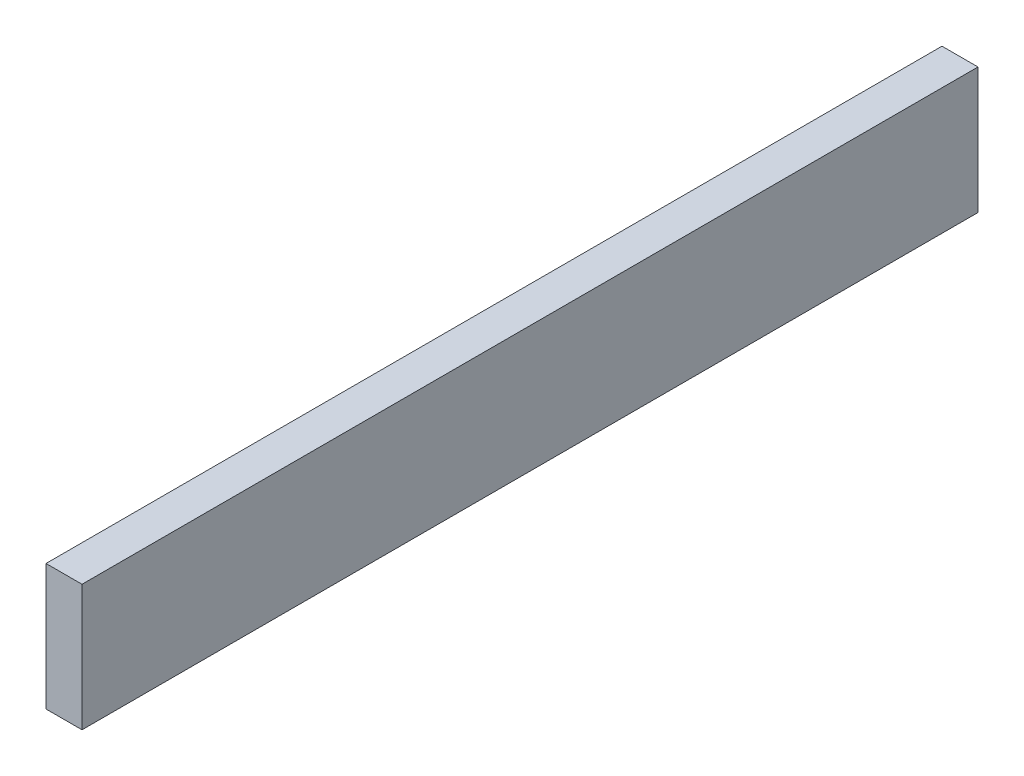
ISO-10303-21;
HEADER;
FILE_DESCRIPTION(('STEP AP214'),'2;1');
FILE_NAME('part.step','',(''),(''),'','','');
FILE_SCHEMA(('AUTOMOTIVE_DESIGN { 1 0 10303 214 1 1 1 1 }'));
ENDSEC;
DATA;
#1=APPLICATION_CONTEXT('core data for automotive mechanical design processes');
#2=APPLICATION_PROTOCOL_DEFINITION('international standard','automotive_design',2000,#1);
#3=PRODUCT_CONTEXT('',#1,'mechanical');
#4=PRODUCT('Part','Part','',(#3));
#5=PRODUCT_RELATED_PRODUCT_CATEGORY('part','',(#4));
#6=PRODUCT_DEFINITION_FORMATION('','',#4);
#7=PRODUCT_DEFINITION_CONTEXT('part definition',#1,'design');
#8=PRODUCT_DEFINITION('design','',#6,#7);
#9=PRODUCT_DEFINITION_SHAPE('','',#8);
#10=(LENGTH_UNIT() NAMED_UNIT(*) SI_UNIT(.MILLI.,.METRE.));
#11=(NAMED_UNIT(*) PLANE_ANGLE_UNIT() SI_UNIT($,.RADIAN.));
#12=(NAMED_UNIT(*) SI_UNIT($,.STERADIAN.) SOLID_ANGLE_UNIT());
#13=UNCERTAINTY_MEASURE_WITH_UNIT(LENGTH_MEASURE(1.E-05),#10,'distance_accuracy_value','');
#14=(GEOMETRIC_REPRESENTATION_CONTEXT(3) GLOBAL_UNCERTAINTY_ASSIGNED_CONTEXT((#13)) GLOBAL_UNIT_ASSIGNED_CONTEXT((#10,
#11,#12)) REPRESENTATION_CONTEXT('',''));
#15=CARTESIAN_POINT('',(0.,0.,0.));
#16=DIRECTION('',(0.,0.,1.));
#17=DIRECTION('',(1.,0.,0.));
#18=AXIS2_PLACEMENT_3D('',#15,#16,#17);
#19=CARTESIAN_POINT('',(-4.,7.,-49.75));
#20=DIRECTION('',(0.,0.,-1.));
#21=DIRECTION('',(0.,1.,0.));
#22=AXIS2_PLACEMENT_3D('',#19,#20,#21);
#23=PLANE('',#22);
#24=DIRECTION('',(0.,1.,0.));
#25=VECTOR('',#24,1.);
#26=CARTESIAN_POINT('',(0.,7.,-49.75));
#27=LINE('',#26,#25);
#28=CARTESIAN_POINT('',(0.,-7.,-49.75));
#29=VERTEX_POINT('',#28);
#30=CARTESIAN_POINT('',(0.,7.,-49.75));
#31=VERTEX_POINT('',#30);
#32=EDGE_CURVE('E101',#29,#31,#27,.T.);
#33=ORIENTED_EDGE('',*,*,#32,.F.);
#34=DIRECTION('',(1.,0.,0.));
#35=VECTOR('',#34,1.);
#36=CARTESIAN_POINT('',(-4.,-7.,-49.75));
#37=LINE('',#36,#35);
#38=CARTESIAN_POINT('',(-4.,-7.,-49.75));
#39=VERTEX_POINT('',#38);
#40=EDGE_CURVE('E11',#39,#29,#37,.T.);
#41=ORIENTED_EDGE('',*,*,#40,.F.);
#42=DIRECTION('',(0.,1.,0.));
#43=VECTOR('',#42,1.);
#44=CARTESIAN_POINT('',(-4.,7.,-49.75));
#45=LINE('',#44,#43);
#46=CARTESIAN_POINT('',(-4.,7.,-49.75));
#47=VERTEX_POINT('',#46);
#48=EDGE_CURVE('E95',#39,#47,#45,.T.);
#49=ORIENTED_EDGE('',*,*,#48,.T.);
#50=DIRECTION('',(1.,0.,0.));
#51=VECTOR('',#50,1.);
#52=CARTESIAN_POINT('',(-4.,7.,-49.75));
#53=LINE('',#52,#51);
#54=EDGE_CURVE('E40',#47,#31,#53,.T.);
#55=ORIENTED_EDGE('',*,*,#54,.T.);
#56=EDGE_LOOP('',(#33,#41,#49,#55));
#57=FACE_BOUND('',#56,.T.);
#58=ADVANCED_FACE('F37',(#57),#23,.T.);
#59=CARTESIAN_POINT('',(-4.,-7.,49.75));
#60=DIRECTION('',(0.,-1.,0.));
#61=DIRECTION('',(0.,0.,-1.));
#62=AXIS2_PLACEMENT_3D('',#59,#60,#61);
#63=PLANE('',#62);
#64=DIRECTION('',(0.,0.,-1.));
#65=VECTOR('',#64,1.);
#66=CARTESIAN_POINT('',(0.,-7.,49.75));
#67=LINE('',#66,#65);
#68=CARTESIAN_POINT('',(0.,-7.,49.75));
#69=VERTEX_POINT('',#68);
#70=EDGE_CURVE('E97',#69,#29,#67,.T.);
#71=ORIENTED_EDGE('',*,*,#70,.F.);
#72=DIRECTION('',(1.,0.,0.));
#73=VECTOR('',#72,1.);
#74=CARTESIAN_POINT('',(-4.,-7.,49.75));
#75=LINE('',#74,#73);
#76=CARTESIAN_POINT('',(-4.,-7.,49.75));
#77=VERTEX_POINT('',#76);
#78=EDGE_CURVE('E46',#77,#69,#75,.T.);
#79=ORIENTED_EDGE('',*,*,#78,.F.);
#80=DIRECTION('',(0.,0.,-1.));
#81=VECTOR('',#80,1.);
#82=CARTESIAN_POINT('',(-4.,-7.,49.75));
#83=LINE('',#82,#81);
#84=EDGE_CURVE('E92',#77,#39,#83,.T.);
#85=ORIENTED_EDGE('',*,*,#84,.T.);
#86=ORIENTED_EDGE('',*,*,#40,.T.);
#87=EDGE_LOOP('',(#71,#79,#85,#86));
#88=FACE_BOUND('',#87,.T.);
#89=ADVANCED_FACE('F111',(#88),#63,.T.);
#90=CARTESIAN_POINT('',(-4.,7.,49.75));
#91=DIRECTION('',(0.,0.,1.));
#92=DIRECTION('',(0.,-1.,0.));
#93=AXIS2_PLACEMENT_3D('',#90,#91,#92);
#94=PLANE('',#93);
#95=DIRECTION('',(0.,-1.,0.));
#96=VECTOR('',#95,1.);
#97=CARTESIAN_POINT('',(0.,7.,49.75));
#98=LINE('',#97,#96);
#99=CARTESIAN_POINT('',(0.,7.,49.75));
#100=VERTEX_POINT('',#99);
#101=EDGE_CURVE('E87',#100,#69,#98,.T.);
#102=ORIENTED_EDGE('',*,*,#101,.F.);
#103=DIRECTION('',(1.,0.,0.));
#104=VECTOR('',#103,1.);
#105=CARTESIAN_POINT('',(-4.,7.,49.75));
#106=LINE('',#105,#104);
#107=CARTESIAN_POINT('',(-4.,7.,49.75));
#108=VERTEX_POINT('',#107);
#109=EDGE_CURVE('E82',#108,#100,#106,.T.);
#110=ORIENTED_EDGE('',*,*,#109,.F.);
#111=DIRECTION('',(0.,-1.,0.));
#112=VECTOR('',#111,1.);
#113=CARTESIAN_POINT('',(-4.,7.,49.75));
#114=LINE('',#113,#112);
#115=EDGE_CURVE('E85',#108,#77,#114,.T.);
#116=ORIENTED_EDGE('',*,*,#115,.T.);
#117=ORIENTED_EDGE('',*,*,#78,.T.);
#118=EDGE_LOOP('',(#102,#110,#116,#117));
#119=FACE_BOUND('',#118,.T.);
#120=ADVANCED_FACE('F84',(#119),#94,.T.);
#121=CARTESIAN_POINT('',(-4.,7.,49.75));
#122=DIRECTION('',(0.,1.,0.));
#123=DIRECTION('',(0.,0.,1.));
#124=AXIS2_PLACEMENT_3D('',#121,#122,#123);
#125=PLANE('',#124);
#126=DIRECTION('',(0.,0.,1.));
#127=VECTOR('',#126,1.);
#128=CARTESIAN_POINT('',(0.,7.,49.75));
#129=LINE('',#128,#127);
#130=EDGE_CURVE('E104',#31,#100,#129,.T.);
#131=ORIENTED_EDGE('',*,*,#130,.F.);
#132=ORIENTED_EDGE('',*,*,#54,.F.);
#133=DIRECTION('',(0.,0.,1.));
#134=VECTOR('',#133,1.);
#135=CARTESIAN_POINT('',(-4.,7.,49.75));
#136=LINE('',#135,#134);
#137=EDGE_CURVE('E91',#47,#108,#136,.T.);
#138=ORIENTED_EDGE('',*,*,#137,.T.);
#139=ORIENTED_EDGE('',*,*,#109,.T.);
#140=EDGE_LOOP('',(#131,#132,#138,#139));
#141=FACE_BOUND('',#140,.T.);
#142=ADVANCED_FACE('F94',(#141),#125,.T.);
#143=CARTESIAN_POINT('',(-4.,0.,0.));
#144=DIRECTION('',(1.,0.,0.));
#145=DIRECTION('',(0.,0.,-1.));
#146=AXIS2_PLACEMENT_3D('',#143,#144,#145);
#147=PLANE('',#146);
#148=ORIENTED_EDGE('',*,*,#48,.F.);
#149=ORIENTED_EDGE('',*,*,#84,.F.);
#150=ORIENTED_EDGE('',*,*,#115,.F.);
#151=ORIENTED_EDGE('',*,*,#137,.F.);
#152=EDGE_LOOP('',(#148,#149,#150,#151));
#153=FACE_BOUND('',#152,.T.);
#154=ADVANCED_FACE('F90',(#153),#147,.F.);
#155=CARTESIAN_POINT('',(0.,0.,0.));
#156=DIRECTION('',(1.,0.,0.));
#157=DIRECTION('',(0.,0.,-1.));
#158=AXIS2_PLACEMENT_3D('',#155,#156,#157);
#159=PLANE('',#158);
#160=ORIENTED_EDGE('',*,*,#32,.T.);
#161=ORIENTED_EDGE('',*,*,#130,.T.);
#162=ORIENTED_EDGE('',*,*,#101,.T.);
#163=ORIENTED_EDGE('',*,*,#70,.T.);
#164=EDGE_LOOP('',(#160,#161,#162,#163));
#165=FACE_BOUND('',#164,.T.);
#166=ADVANCED_FACE('F110',(#165),#159,.T.);
#167=CLOSED_SHELL('',(#58,#89,#120,#142,#154,#166));
#168=MANIFOLD_SOLID_BREP('B2',#167);
#169=ADVANCED_BREP_SHAPE_REPRESENTATION('',(#18,#168),#14);
#170=SHAPE_DEFINITION_REPRESENTATION(#9,#169);
ENDSEC;
END-ISO-10303-21;
